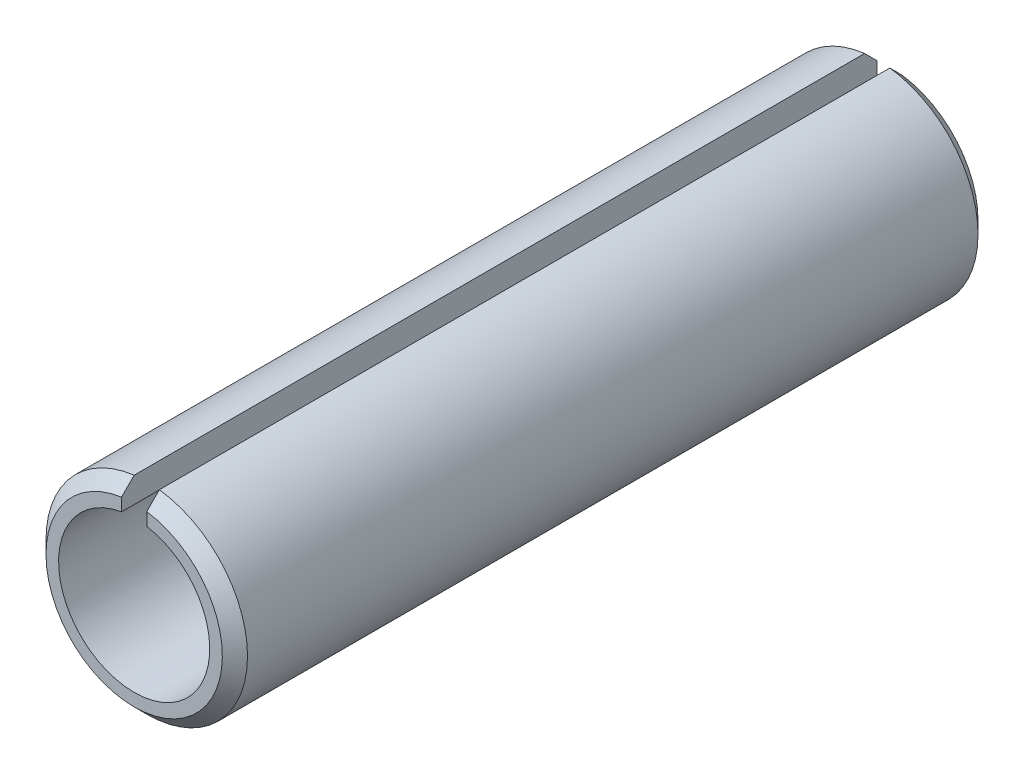
ISO-10303-21;
HEADER;
FILE_DESCRIPTION(('STEP AP214'),'2;1');
FILE_NAME('part.step','',(''),(''),'','','');
FILE_SCHEMA(('AUTOMOTIVE_DESIGN { 1 0 10303 214 1 1 1 1 }'));
ENDSEC;
DATA;
#1=APPLICATION_CONTEXT('core data for automotive mechanical design processes');
#2=APPLICATION_PROTOCOL_DEFINITION('international standard','automotive_design',2000,#1);
#3=PRODUCT_CONTEXT('',#1,'mechanical');
#4=PRODUCT('Part','Part','',(#3));
#5=PRODUCT_RELATED_PRODUCT_CATEGORY('part','',(#4));
#6=PRODUCT_DEFINITION_FORMATION('','',#4);
#7=PRODUCT_DEFINITION_CONTEXT('part definition',#1,'design');
#8=PRODUCT_DEFINITION('design','',#6,#7);
#9=PRODUCT_DEFINITION_SHAPE('','',#8);
#10=(LENGTH_UNIT() NAMED_UNIT(*) SI_UNIT(.MILLI.,.METRE.));
#11=(NAMED_UNIT(*) PLANE_ANGLE_UNIT() SI_UNIT($,.RADIAN.));
#12=(NAMED_UNIT(*) SI_UNIT($,.STERADIAN.) SOLID_ANGLE_UNIT());
#13=UNCERTAINTY_MEASURE_WITH_UNIT(LENGTH_MEASURE(1.E-05),#10,'distance_accuracy_value','');
#14=(GEOMETRIC_REPRESENTATION_CONTEXT(3) GLOBAL_UNCERTAINTY_ASSIGNED_CONTEXT((#13)) GLOBAL_UNIT_ASSIGNED_CONTEXT((#10,
#11,#12)) REPRESENTATION_CONTEXT('',''));
#15=CARTESIAN_POINT('',(0.,0.,0.));
#16=DIRECTION('',(0.,0.,1.));
#17=DIRECTION('',(1.,0.,0.));
#18=AXIS2_PLACEMENT_3D('',#15,#16,#17);
#19=CARTESIAN_POINT('',(0.,0.,15.));
#20=DIRECTION('',(0.,0.,-1.));
#21=DIRECTION('',(-1.,0.,0.));
#22=AXIS2_PLACEMENT_3D('',#19,#20,#21);
#23=CYLINDRICAL_SURFACE('',#22,4.);
#24=DIRECTION('',(0.,0.,-1.));
#25=VECTOR('',#24,1.);
#26=CARTESIAN_POINT('',(-0.5,3.96862696659689,15.));
#27=LINE('',#26,#25);
#28=CARTESIAN_POINT('',(-0.5,3.96862696659689,14.5));
#29=VERTEX_POINT('',#28);
#30=CARTESIAN_POINT('',(-0.5,3.96862696659689,-14.5));
#31=VERTEX_POINT('',#30);
#32=EDGE_CURVE('E119',#29,#31,#27,.T.);
#33=ORIENTED_EDGE('',*,*,#32,.T.);
#34=CARTESIAN_POINT('',(0.,0.,-14.5));
#35=DIRECTION('',(0.,0.,1.));
#36=DIRECTION('',(1.,0.,0.));
#37=AXIS2_PLACEMENT_3D('',#34,#35,#36);
#38=CIRCLE('',#37,4.);
#39=CARTESIAN_POINT('',(0.5,3.96862696659689,-14.5));
#40=VERTEX_POINT('',#39);
#41=EDGE_CURVE('E126',#31,#40,#38,.T.);
#42=ORIENTED_EDGE('',*,*,#41,.T.);
#43=DIRECTION('',(0.,0.,-1.));
#44=VECTOR('',#43,1.);
#45=CARTESIAN_POINT('',(0.5,3.96862696659689,15.));
#46=LINE('',#45,#44);
#47=CARTESIAN_POINT('',(0.5,3.96862696659689,14.5));
#48=VERTEX_POINT('',#47);
#49=EDGE_CURVE('E106',#48,#40,#46,.T.);
#50=ORIENTED_EDGE('',*,*,#49,.F.);
#51=CARTESIAN_POINT('',(0.,0.,14.5));
#52=DIRECTION('',(0.,0.,1.));
#53=DIRECTION('',(1.,0.,0.));
#54=AXIS2_PLACEMENT_3D('',#51,#52,#53);
#55=CIRCLE('',#54,4.);
#56=EDGE_CURVE('E124',#48,#29,#55,.F.);
#57=ORIENTED_EDGE('',*,*,#56,.T.);
#58=EDGE_LOOP('',(#33,#42,#50,#57));
#59=FACE_BOUND('',#58,.T.);
#60=ADVANCED_FACE('F35',(#59),#23,.T.);
#61=CARTESIAN_POINT('',(0.5,3.96862696659689,15.));
#62=DIRECTION('',(1.,0.,0.));
#63=DIRECTION('',(0.,1.,0.));
#64=AXIS2_PLACEMENT_3D('',#61,#62,#63);
#65=PLANE('',#64);
#66=ORIENTED_EDGE('',*,*,#49,.T.);
#67=CARTESIAN_POINT('',(0.5,3.96862696659689,-14.5));
#68=CARTESIAN_POINT('',(0.5,3.88458991571911,-14.5833842971325));
#69=CARTESIAN_POINT('',(0.5,3.80052761124953,-14.6667431121105));
#70=CARTESIAN_POINT('',(0.5,3.63235249409711,-14.8334097787778));
#71=CARTESIAN_POINT('',(0.5,3.54823968141364,-14.9167176304665));
#72=CARTESIAN_POINT('',(0.5,3.46410161513775,-15.));
#73=B_SPLINE_CURVE_WITH_KNOTS('',3,(#67,#68,#69,#70,#71,#72),.UNSPECIFIED.,.F.,.F.,(4,2,4),(0.,
0.355156961927304,0.71031392820357),.UNSPECIFIED.);
#74=CARTESIAN_POINT('',(0.5,3.46410161513775,-15.));
#75=VERTEX_POINT('',#74);
#76=EDGE_CURVE('E97',#40,#75,#73,.T.);
#77=ORIENTED_EDGE('',*,*,#76,.T.);
#78=DIRECTION('',(0.,-1.,0.));
#79=VECTOR('',#78,1.);
#80=CARTESIAN_POINT('',(0.5,3.96862696659689,-15.));
#81=LINE('',#80,#79);
#82=CARTESIAN_POINT('',(0.5,2.95803989154981,-15.));
#83=VERTEX_POINT('',#82);
#84=EDGE_CURVE('E90',#75,#83,#81,.T.);
#85=ORIENTED_EDGE('',*,*,#84,.T.);
#86=DIRECTION('',(0.,0.,-1.));
#87=VECTOR('',#86,1.);
#88=CARTESIAN_POINT('',(0.5,2.95803989154981,15.));
#89=LINE('',#88,#87);
#90=CARTESIAN_POINT('',(0.5,2.95803989154981,15.));
#91=VERTEX_POINT('',#90);
#92=EDGE_CURVE('E95',#91,#83,#89,.T.);
#93=ORIENTED_EDGE('',*,*,#92,.F.);
#94=DIRECTION('',(0.,-1.,0.));
#95=VECTOR('',#94,1.);
#96=CARTESIAN_POINT('',(0.5,3.96862696659689,15.));
#97=LINE('',#96,#95);
#98=CARTESIAN_POINT('',(0.5,3.46410161513775,15.));
#99=VERTEX_POINT('',#98);
#100=EDGE_CURVE('E112',#99,#91,#97,.T.);
#101=ORIENTED_EDGE('',*,*,#100,.F.);
#102=CARTESIAN_POINT('',(0.5,3.46410161513776,15.));
#103=CARTESIAN_POINT('',(0.5,3.54823968141364,14.9167176304665));
#104=CARTESIAN_POINT('',(0.5,3.63235249409711,14.8334097787778));
#105=CARTESIAN_POINT('',(0.5,3.80052761124953,14.6667431121105));
#106=CARTESIAN_POINT('',(0.5,3.88458991571911,14.5833842971325));
#107=CARTESIAN_POINT('',(0.5,3.96862696659689,14.5));
#108=B_SPLINE_CURVE_WITH_KNOTS('',3,(#102,#103,#104,#105,#106,#107),.UNSPECIFIED.,.F.,.F.,(4,2,
4),(0.,0.355156966276267,0.710313928203573),.UNSPECIFIED.);
#109=EDGE_CURVE('E129',#99,#48,#108,.T.);
#110=ORIENTED_EDGE('',*,*,#109,.T.);
#111=EDGE_LOOP('',(#66,#77,#85,#93,#101,#110));
#112=FACE_BOUND('',#111,.T.);
#113=ADVANCED_FACE('F93',(#112),#65,.F.);
#114=CARTESIAN_POINT('',(0.,0.,15.));
#115=DIRECTION('',(0.,0.,-1.));
#116=DIRECTION('',(-1.,0.,0.));
#117=AXIS2_PLACEMENT_3D('',#114,#115,#116);
#118=CYLINDRICAL_SURFACE('',#117,3.);
#119=ORIENTED_EDGE('',*,*,#92,.T.);
#120=CARTESIAN_POINT('',(0.,0.,-15.));
#121=DIRECTION('',(0.,0.,-1.));
#122=DIRECTION('',(1.,0.,0.));
#123=AXIS2_PLACEMENT_3D('',#120,#121,#122);
#124=CIRCLE('',#123,3.);
#125=CARTESIAN_POINT('',(-0.5,2.95803989154981,-15.));
#126=VERTEX_POINT('',#125);
#127=EDGE_CURVE('E99',#83,#126,#124,.T.);
#128=ORIENTED_EDGE('',*,*,#127,.T.);
#129=DIRECTION('',(0.,0.,-1.));
#130=VECTOR('',#129,1.);
#131=CARTESIAN_POINT('',(-0.5,2.95803989154981,15.));
#132=LINE('',#131,#130);
#133=CARTESIAN_POINT('',(-0.5,2.95803989154981,15.));
#134=VERTEX_POINT('',#133);
#135=EDGE_CURVE('E107',#134,#126,#132,.T.);
#136=ORIENTED_EDGE('',*,*,#135,.F.);
#137=CARTESIAN_POINT('',(0.,0.,15.));
#138=DIRECTION('',(0.,0.,-1.));
#139=DIRECTION('',(1.,0.,0.));
#140=AXIS2_PLACEMENT_3D('',#137,#138,#139);
#141=CIRCLE('',#140,3.);
#142=EDGE_CURVE('E105',#91,#134,#141,.T.);
#143=ORIENTED_EDGE('',*,*,#142,.F.);
#144=EDGE_LOOP('',(#119,#128,#136,#143));
#145=FACE_BOUND('',#144,.T.);
#146=ADVANCED_FACE('F103',(#145),#118,.F.);
#147=CARTESIAN_POINT('',(-0.5,3.96862696659689,15.));
#148=DIRECTION('',(-1.,0.,0.));
#149=DIRECTION('',(0.,-1.,0.));
#150=AXIS2_PLACEMENT_3D('',#147,#148,#149);
#151=PLANE('',#150);
#152=DIRECTION('',(0.,1.,0.));
#153=VECTOR('',#152,1.);
#154=CARTESIAN_POINT('',(-0.5,3.96862696659689,-15.));
#155=LINE('',#154,#153);
#156=CARTESIAN_POINT('',(-0.5,3.46410161513775,-15.));
#157=VERTEX_POINT('',#156);
#158=EDGE_CURVE('E110',#126,#157,#155,.T.);
#159=ORIENTED_EDGE('',*,*,#158,.T.);
#160=CARTESIAN_POINT('',(-0.5,3.46410161513775,-15.));
#161=CARTESIAN_POINT('',(-0.5,3.54823968141364,-14.9167176304665));
#162=CARTESIAN_POINT('',(-0.5,3.63235249409711,-14.8334097787778));
#163=CARTESIAN_POINT('',(-0.5,3.80052761124953,-14.6667431121105));
#164=CARTESIAN_POINT('',(-0.5,3.88458991571911,-14.5833842971325));
#165=CARTESIAN_POINT('',(-0.5,3.96862696659689,-14.5));
#166=B_SPLINE_CURVE_WITH_KNOTS('',3,(#160,#161,#162,#163,#164,#165),.UNSPECIFIED.,.F.,.F.,(4,2,
4),(0.,0.355156966276265,0.710313928203569),.UNSPECIFIED.);
#167=EDGE_CURVE('E42',#157,#31,#166,.T.);
#168=ORIENTED_EDGE('',*,*,#167,.T.);
#169=ORIENTED_EDGE('',*,*,#32,.F.);
#170=CARTESIAN_POINT('',(-0.5,3.96862696659689,14.5));
#171=CARTESIAN_POINT('',(-0.5,3.88458991571911,14.5833842971325));
#172=CARTESIAN_POINT('',(-0.5,3.80052761124953,14.6667431121105));
#173=CARTESIAN_POINT('',(-0.5,3.63235249409711,14.8334097787778));
#174=CARTESIAN_POINT('',(-0.5,3.54823968141364,14.9167176304665));
#175=CARTESIAN_POINT('',(-0.5,3.46410161513776,15.));
#176=B_SPLINE_CURVE_WITH_KNOTS('',3,(#170,#171,#172,#173,#174,#175),.UNSPECIFIED.,.F.,.F.,(4,2,
4),(0.,0.355156961927307,0.710313928203574),.UNSPECIFIED.);
#177=CARTESIAN_POINT('',(-0.5,3.46410161513775,15.));
#178=VERTEX_POINT('',#177);
#179=EDGE_CURVE('E49',#29,#178,#176,.T.);
#180=ORIENTED_EDGE('',*,*,#179,.T.);
#181=DIRECTION('',(0.,1.,0.));
#182=VECTOR('',#181,1.);
#183=CARTESIAN_POINT('',(-0.5,3.96862696659689,15.));
#184=LINE('',#183,#182);
#185=EDGE_CURVE('E117',#134,#178,#184,.T.);
#186=ORIENTED_EDGE('',*,*,#185,.F.);
#187=ORIENTED_EDGE('',*,*,#135,.T.);
#188=EDGE_LOOP('',(#159,#168,#169,#180,#186,#187));
#189=FACE_BOUND('',#188,.T.);
#190=ADVANCED_FACE('F148',(#189),#151,.F.);
#191=CARTESIAN_POINT('',(0.,0.,15.));
#192=DIRECTION('',(0.,0.,1.));
#193=DIRECTION('',(1.,0.,0.));
#194=AXIS2_PLACEMENT_3D('',#191,#192,#193);
#195=PLANE('',#194);
#196=ORIENTED_EDGE('',*,*,#185,.T.);
#197=CARTESIAN_POINT('',(0.,0.,15.));
#198=DIRECTION('',(0.,0.,1.));
#199=DIRECTION('',(1.,0.,0.));
#200=AXIS2_PLACEMENT_3D('',#197,#198,#199);
#201=CIRCLE('',#200,3.5);
#202=EDGE_CURVE('E11',#178,#99,#201,.T.);
#203=ORIENTED_EDGE('',*,*,#202,.T.);
#204=ORIENTED_EDGE('',*,*,#100,.T.);
#205=ORIENTED_EDGE('',*,*,#142,.T.);
#206=EDGE_LOOP('',(#196,#203,#204,#205));
#207=FACE_BOUND('',#206,.T.);
#208=ADVANCED_FACE('F152',(#207),#195,.T.);
#209=CARTESIAN_POINT('',(0.,0.,-15.));
#210=DIRECTION('',(0.,0.,1.));
#211=DIRECTION('',(1.,0.,0.));
#212=AXIS2_PLACEMENT_3D('',#209,#210,#211);
#213=PLANE('',#212);
#214=ORIENTED_EDGE('',*,*,#84,.F.);
#215=CARTESIAN_POINT('',(0.,0.,-15.));
#216=DIRECTION('',(0.,0.,1.));
#217=DIRECTION('',(1.,0.,0.));
#218=AXIS2_PLACEMENT_3D('',#215,#216,#217);
#219=CIRCLE('',#218,3.5);
#220=EDGE_CURVE('E57',#75,#157,#219,.F.);
#221=ORIENTED_EDGE('',*,*,#220,.T.);
#222=ORIENTED_EDGE('',*,*,#158,.F.);
#223=ORIENTED_EDGE('',*,*,#127,.F.);
#224=EDGE_LOOP('',(#214,#221,#222,#223));
#225=FACE_BOUND('',#224,.T.);
#226=ADVANCED_FACE('F109',(#225),#213,.F.);
#227=CARTESIAN_POINT('',(0.,0.,-14.5));
#228=DIRECTION('',(0.,0.,1.));
#229=DIRECTION('',(1.,0.,0.));
#230=AXIS2_PLACEMENT_3D('',#227,#228,#229);
#231=CONICAL_SURFACE('',#230,4.,0.785398163397451);
#232=ORIENTED_EDGE('',*,*,#167,.F.);
#233=ORIENTED_EDGE('',*,*,#220,.F.);
#234=ORIENTED_EDGE('',*,*,#76,.F.);
#235=ORIENTED_EDGE('',*,*,#41,.F.);
#236=EDGE_LOOP('',(#232,#233,#234,#235));
#237=FACE_BOUND('',#236,.T.);
#238=ADVANCED_FACE('F162',(#237),#231,.T.);
#239=CARTESIAN_POINT('',(0.,0.,15.));
#240=DIRECTION('',(0.,0.,-1.));
#241=DIRECTION('',(-1.,0.,0.));
#242=AXIS2_PLACEMENT_3D('',#239,#240,#241);
#243=CONICAL_SURFACE('',#242,3.5,0.785398163397444);
#244=ORIENTED_EDGE('',*,*,#179,.F.);
#245=ORIENTED_EDGE('',*,*,#56,.F.);
#246=ORIENTED_EDGE('',*,*,#109,.F.);
#247=ORIENTED_EDGE('',*,*,#202,.F.);
#248=EDGE_LOOP('',(#244,#245,#246,#247));
#249=FACE_BOUND('',#248,.T.);
#250=ADVANCED_FACE('F140',(#249),#243,.T.);
#251=CLOSED_SHELL('',(#60,#113,#146,#190,#208,#226,#238,#250));
#252=MANIFOLD_SOLID_BREP('B2',#251);
#253=ADVANCED_BREP_SHAPE_REPRESENTATION('',(#18,#252),#14);
#254=SHAPE_DEFINITION_REPRESENTATION(#9,#253);
ENDSEC;
END-ISO-10303-21;
